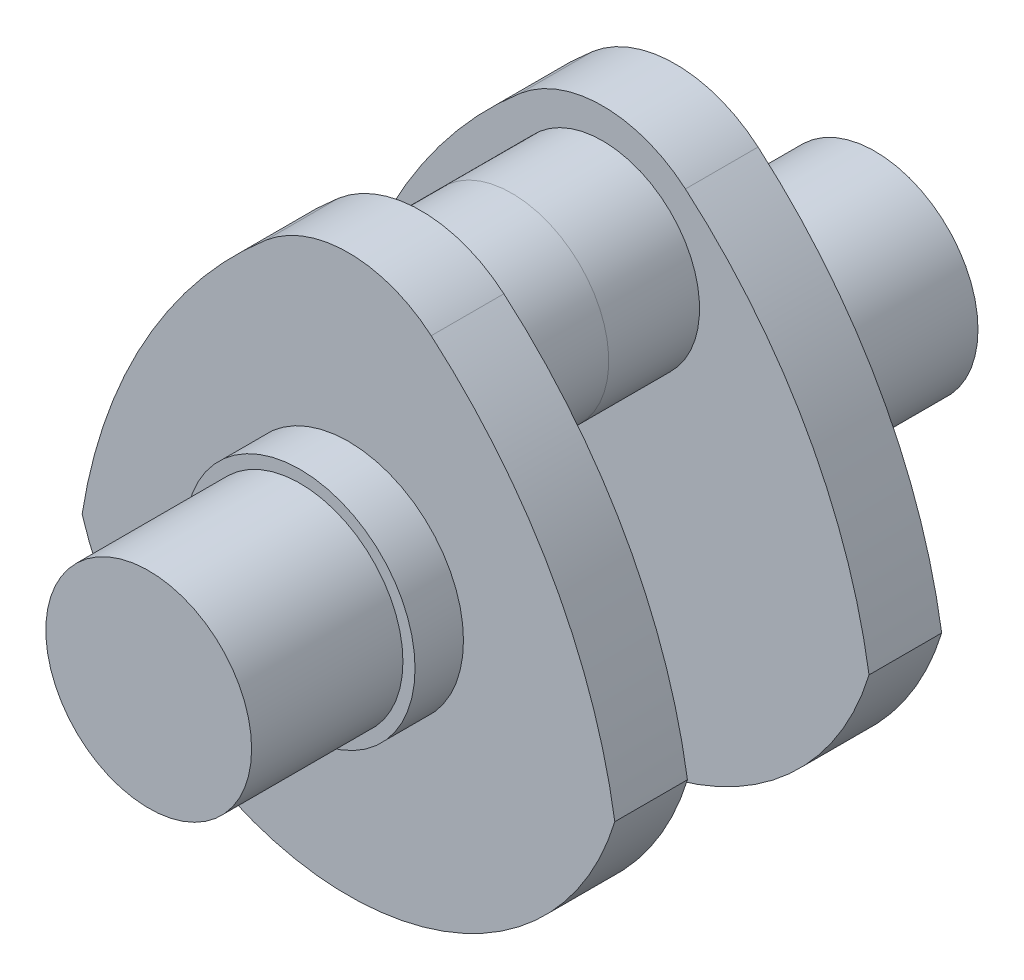
ISO-10303-21;
HEADER;
FILE_DESCRIPTION(('STEP AP214'),'2;1');
FILE_NAME('part.step','',(''),(''),'','','');
FILE_SCHEMA(('AUTOMOTIVE_DESIGN { 1 0 10303 214 1 1 1 1 }'));
ENDSEC;
DATA;
#1=APPLICATION_CONTEXT('core data for automotive mechanical design processes');
#2=APPLICATION_PROTOCOL_DEFINITION('international standard','automotive_design',2000,#1);
#3=PRODUCT_CONTEXT('',#1,'mechanical');
#4=PRODUCT('Part','Part','',(#3));
#5=PRODUCT_RELATED_PRODUCT_CATEGORY('part','',(#4));
#6=PRODUCT_DEFINITION_FORMATION('','',#4);
#7=PRODUCT_DEFINITION_CONTEXT('part definition',#1,'design');
#8=PRODUCT_DEFINITION('design','',#6,#7);
#9=PRODUCT_DEFINITION_SHAPE('','',#8);
#10=(LENGTH_UNIT() NAMED_UNIT(*) SI_UNIT(.MILLI.,.METRE.));
#11=(NAMED_UNIT(*) PLANE_ANGLE_UNIT() SI_UNIT($,.RADIAN.));
#12=(NAMED_UNIT(*) SI_UNIT($,.STERADIAN.) SOLID_ANGLE_UNIT());
#13=UNCERTAINTY_MEASURE_WITH_UNIT(LENGTH_MEASURE(1.E-05),#10,'distance_accuracy_value','');
#14=(GEOMETRIC_REPRESENTATION_CONTEXT(3) GLOBAL_UNCERTAINTY_ASSIGNED_CONTEXT((#13)) GLOBAL_UNIT_ASSIGNED_CONTEXT((#10,
#11,#12)) REPRESENTATION_CONTEXT('',''));
#15=CARTESIAN_POINT('',(0.,0.,0.));
#16=DIRECTION('',(0.,0.,1.));
#17=DIRECTION('',(1.,0.,0.));
#18=AXIS2_PLACEMENT_3D('',#15,#16,#17);
#19=CARTESIAN_POINT('',(0.,0.,-95.));
#20=DIRECTION('',(0.,0.,1.));
#21=DIRECTION('',(-1.,0.,0.));
#22=AXIS2_PLACEMENT_3D('',#19,#20,#21);
#23=CYLINDRICAL_SURFACE('',#22,17.);
#24=CARTESIAN_POINT('',(0.,0.,-95.));
#25=DIRECTION('',(0.,0.,1.));
#26=DIRECTION('',(1.,0.,0.));
#27=AXIS2_PLACEMENT_3D('',#24,#25,#26);
#28=CIRCLE('',#27,17.);
#29=CARTESIAN_POINT('',(17.,0.,-95.));
#30=VERTEX_POINT('',#29);
#31=EDGE_CURVE('E12',#30,#30,#28,.T.);
#32=ORIENTED_EDGE('',*,*,#31,.T.);
#33=EDGE_LOOP('',(#32));
#34=FACE_BOUND('',#33,.T.);
#35=CARTESIAN_POINT('',(0.,0.,-70.));
#36=DIRECTION('',(0.,0.,1.));
#37=DIRECTION('',(1.,0.,0.));
#38=AXIS2_PLACEMENT_3D('',#35,#36,#37);
#39=CIRCLE('',#38,17.);
#40=CARTESIAN_POINT('',(17.,0.,-70.));
#41=VERTEX_POINT('',#40);
#42=EDGE_CURVE('E56',#41,#41,#39,.T.);
#43=ORIENTED_EDGE('',*,*,#42,.F.);
#44=EDGE_LOOP('',(#43));
#45=FACE_BOUND('',#44,.T.);
#46=ADVANCED_FACE('F53',(#34,#45),#23,.T.);
#47=CARTESIAN_POINT('',(0.,0.,-95.));
#48=DIRECTION('',(0.,0.,-1.));
#49=DIRECTION('',(1.,0.,0.));
#50=AXIS2_PLACEMENT_3D('',#47,#48,#49);
#51=PLANE('',#50);
#52=ORIENTED_EDGE('',*,*,#31,.F.);
#53=EDGE_LOOP('',(#52));
#54=FACE_BOUND('',#53,.T.);
#55=ADVANCED_FACE('F161',(#54),#51,.T.);
#56=CARTESIAN_POINT('',(0.,0.,-62.));
#57=DIRECTION('',(0.,0.,-1.));
#58=DIRECTION('',(1.,0.,0.));
#59=AXIS2_PLACEMENT_3D('',#56,#57,#58);
#60=CYLINDRICAL_SURFACE('',#59,19.);
#61=CARTESIAN_POINT('',(0.,0.,-62.));
#62=DIRECTION('',(0.,0.,1.));
#63=DIRECTION('',(1.,0.,0.));
#64=AXIS2_PLACEMENT_3D('',#61,#62,#63);
#65=CIRCLE('',#64,19.);
#66=CARTESIAN_POINT('',(19.,0.,-62.));
#67=VERTEX_POINT('',#66);
#68=EDGE_CURVE('E144',#67,#67,#65,.T.);
#69=ORIENTED_EDGE('',*,*,#68,.F.);
#70=EDGE_LOOP('',(#69));
#71=FACE_BOUND('',#70,.T.);
#72=CARTESIAN_POINT('',(0.,0.,-70.));
#73=DIRECTION('',(0.,0.,1.));
#74=DIRECTION('',(1.,0.,0.));
#75=AXIS2_PLACEMENT_3D('',#72,#73,#74);
#76=CIRCLE('',#75,19.);
#77=CARTESIAN_POINT('',(19.,0.,-70.));
#78=VERTEX_POINT('',#77);
#79=EDGE_CURVE('E148',#78,#78,#76,.T.);
#80=ORIENTED_EDGE('',*,*,#79,.T.);
#81=EDGE_LOOP('',(#80));
#82=FACE_BOUND('',#81,.T.);
#83=ADVANCED_FACE('F166',(#71,#82),#60,.T.);
#84=CARTESIAN_POINT('',(0.,0.,-70.));
#85=DIRECTION('',(0.,0.,-1.));
#86=DIRECTION('',(1.,0.,0.));
#87=AXIS2_PLACEMENT_3D('',#84,#85,#86);
#88=PLANE('',#87);
#89=ORIENTED_EDGE('',*,*,#42,.T.);
#90=EDGE_LOOP('',(#89));
#91=FACE_BOUND('',#90,.T.);
#92=ORIENTED_EDGE('',*,*,#79,.F.);
#93=EDGE_LOOP('',(#92));
#94=FACE_BOUND('',#93,.T.);
#95=ADVANCED_FACE('F157',(#91,#94),#88,.T.);
#96=CARTESIAN_POINT('',(-44.9094542035734,-27.3845485151599,-50.));
#97=DIRECTION('',(0.,0.,-1.));
#98=DIRECTION('',(1.,0.,0.));
#99=AXIS2_PLACEMENT_3D('',#96,#97,#98);
#100=CYLINDRICAL_SURFACE('',#99,90.);
#101=CARTESIAN_POINT('',(-44.9094542035734,-27.3845485151599,-62.));
#102=DIRECTION('',(0.,0.,-1.));
#103=DIRECTION('',(-1.,0.,0.));
#104=AXIS2_PLACEMENT_3D('',#101,#102,#103);
#105=CIRCLE('',#104,90.);
#106=CARTESIAN_POINT('',(13.6680947576093,40.9431234611356,-62.));
#107=VERTEX_POINT('',#106);
#108=CARTESIAN_POINT('',(44.,-13.4164078649987,-62.));
#109=VERTEX_POINT('',#108);
#110=EDGE_CURVE('E127',#107,#109,#105,.T.);
#111=ORIENTED_EDGE('',*,*,#110,.F.);
#112=DIRECTION('',(0.,0.,-1.));
#113=VECTOR('',#112,1.);
#114=CARTESIAN_POINT('',(13.6680947576093,40.9431234611356,-50.));
#115=LINE('',#114,#113);
#116=CARTESIAN_POINT('',(13.6680947576093,40.9431234611356,-50.));
#117=VERTEX_POINT('',#116);
#118=EDGE_CURVE('E126',#117,#107,#115,.T.);
#119=ORIENTED_EDGE('',*,*,#118,.F.);
#120=CARTESIAN_POINT('',(-44.9094542035734,-27.3845485151599,-50.));
#121=DIRECTION('',(0.,0.,-1.));
#122=DIRECTION('',(-1.,0.,0.));
#123=AXIS2_PLACEMENT_3D('',#120,#121,#122);
#124=CIRCLE('',#123,90.);
#125=CARTESIAN_POINT('',(44.,-13.4164078649987,-50.));
#126=VERTEX_POINT('',#125);
#127=EDGE_CURVE('E118',#117,#126,#124,.T.);
#128=ORIENTED_EDGE('',*,*,#127,.T.);
#129=DIRECTION('',(0.,0.,-1.));
#130=VECTOR('',#129,1.);
#131=CARTESIAN_POINT('',(44.,-13.4164078649987,-50.));
#132=LINE('',#131,#130);
#133=EDGE_CURVE('E111',#126,#109,#132,.T.);
#134=ORIENTED_EDGE('',*,*,#133,.T.);
#135=EDGE_LOOP('',(#111,#119,#128,#134));
#136=FACE_BOUND('',#135,.T.);
#137=ADVANCED_FACE('F177',(#136),#100,.T.);
#138=CARTESIAN_POINT('',(0.,0.,-50.));
#139=DIRECTION('',(0.,0.,-1.));
#140=DIRECTION('',(1.,0.,0.));
#141=AXIS2_PLACEMENT_3D('',#138,#139,#140);
#142=CYLINDRICAL_SURFACE('',#141,46.);
#143=CARTESIAN_POINT('',(0.,0.,-62.));
#144=DIRECTION('',(0.,0.,-1.));
#145=DIRECTION('',(-1.,0.,0.));
#146=AXIS2_PLACEMENT_3D('',#143,#144,#145);
#147=CIRCLE('',#146,46.);
#148=CARTESIAN_POINT('',(-44.,-13.4164078649987,-62.));
#149=VERTEX_POINT('',#148);
#150=EDGE_CURVE('E130',#109,#149,#147,.T.);
#151=ORIENTED_EDGE('',*,*,#150,.F.);
#152=ORIENTED_EDGE('',*,*,#133,.F.);
#153=CARTESIAN_POINT('',(0.,0.,-50.));
#154=DIRECTION('',(0.,0.,-1.));
#155=DIRECTION('',(-1.,0.,0.));
#156=AXIS2_PLACEMENT_3D('',#153,#154,#155);
#157=CIRCLE('',#156,46.);
#158=CARTESIAN_POINT('',(-44.,-13.4164078649987,-50.));
#159=VERTEX_POINT('',#158);
#160=EDGE_CURVE('E95',#126,#159,#157,.T.);
#161=ORIENTED_EDGE('',*,*,#160,.T.);
#162=DIRECTION('',(0.,0.,-1.));
#163=VECTOR('',#162,1.);
#164=CARTESIAN_POINT('',(-44.,-13.4164078649987,-50.));
#165=LINE('',#164,#163);
#166=EDGE_CURVE('E105',#159,#149,#165,.T.);
#167=ORIENTED_EDGE('',*,*,#166,.T.);
#168=EDGE_LOOP('',(#151,#152,#161,#167));
#169=FACE_BOUND('',#168,.T.);
#170=ADVANCED_FACE('F114',(#169),#142,.T.);
#171=CARTESIAN_POINT('',(44.9094542035734,-27.3845485151599,-50.));
#172=DIRECTION('',(0.,0.,-1.));
#173=DIRECTION('',(1.,0.,0.));
#174=AXIS2_PLACEMENT_3D('',#171,#172,#173);
#175=CYLINDRICAL_SURFACE('',#174,90.);
#176=CARTESIAN_POINT('',(44.9094542035734,-27.3845485151599,-62.));
#177=DIRECTION('',(0.,0.,-1.));
#178=DIRECTION('',(1.,0.,0.));
#179=AXIS2_PLACEMENT_3D('',#176,#177,#178);
#180=CIRCLE('',#179,90.);
#181=CARTESIAN_POINT('',(-13.6680947576093,40.9431234611356,-62.));
#182=VERTEX_POINT('',#181);
#183=EDGE_CURVE('E107',#149,#182,#180,.T.);
#184=ORIENTED_EDGE('',*,*,#183,.F.);
#185=ORIENTED_EDGE('',*,*,#166,.F.);
#186=CARTESIAN_POINT('',(44.9094542035734,-27.3845485151599,-50.));
#187=DIRECTION('',(0.,0.,-1.));
#188=DIRECTION('',(1.,0.,0.));
#189=AXIS2_PLACEMENT_3D('',#186,#187,#188);
#190=CIRCLE('',#189,90.);
#191=CARTESIAN_POINT('',(-13.6680947576093,40.9431234611356,-50.));
#192=VERTEX_POINT('',#191);
#193=EDGE_CURVE('E98',#159,#192,#190,.T.);
#194=ORIENTED_EDGE('',*,*,#193,.T.);
#195=DIRECTION('',(0.,0.,-1.));
#196=VECTOR('',#195,1.);
#197=CARTESIAN_POINT('',(-13.6680947576093,40.9431234611356,-50.));
#198=LINE('',#197,#196);
#199=EDGE_CURVE('E112',#192,#182,#198,.T.);
#200=ORIENTED_EDGE('',*,*,#199,.T.);
#201=EDGE_LOOP('',(#184,#185,#194,#200));
#202=FACE_BOUND('',#201,.T.);
#203=ADVANCED_FACE('F106',(#202),#175,.T.);
#204=CARTESIAN_POINT('',(0.,25.,-50.));
#205=DIRECTION('',(0.,0.,-1.));
#206=DIRECTION('',(1.,0.,0.));
#207=AXIS2_PLACEMENT_3D('',#204,#205,#206);
#208=CYLINDRICAL_SURFACE('',#207,21.);
#209=CARTESIAN_POINT('',(0.,25.,-62.));
#210=DIRECTION('',(0.,0.,-1.));
#211=DIRECTION('',(-1.,0.,0.));
#212=AXIS2_PLACEMENT_3D('',#209,#210,#211);
#213=CIRCLE('',#212,21.);
#214=EDGE_CURVE('E84',#182,#107,#213,.T.);
#215=ORIENTED_EDGE('',*,*,#214,.F.);
#216=ORIENTED_EDGE('',*,*,#199,.F.);
#217=CARTESIAN_POINT('',(0.,25.,-50.));
#218=DIRECTION('',(0.,0.,-1.));
#219=DIRECTION('',(-1.,0.,0.));
#220=AXIS2_PLACEMENT_3D('',#217,#218,#219);
#221=CIRCLE('',#220,21.);
#222=EDGE_CURVE('E70',#192,#117,#221,.T.);
#223=ORIENTED_EDGE('',*,*,#222,.T.);
#224=ORIENTED_EDGE('',*,*,#118,.T.);
#225=EDGE_LOOP('',(#215,#216,#223,#224));
#226=FACE_BOUND('',#225,.T.);
#227=ADVANCED_FACE('F185',(#226),#208,.T.);
#228=CARTESIAN_POINT('',(-22.4547271017867,-13.69227425758,-50.));
#229=DIRECTION('',(0.,0.,1.));
#230=DIRECTION('',(-1.,0.,0.));
#231=AXIS2_PLACEMENT_3D('',#228,#229,#230);
#232=PLANE('',#231);
#233=CARTESIAN_POINT('',(0.,25.,-50.));
#234=DIRECTION('',(0.,0.,-1.));
#235=DIRECTION('',(-1.,0.,0.));
#236=AXIS2_PLACEMENT_3D('',#233,#234,#235);
#237=CIRCLE('',#236,16.);
#238=CARTESIAN_POINT('',(-16.,25.,-50.));
#239=VERTEX_POINT('',#238);
#240=EDGE_CURVE('E207',#239,#239,#237,.T.);
#241=ORIENTED_EDGE('',*,*,#240,.T.);
#242=EDGE_LOOP('',(#241));
#243=FACE_BOUND('',#242,.T.);
#244=ORIENTED_EDGE('',*,*,#127,.F.);
#245=ORIENTED_EDGE('',*,*,#222,.F.);
#246=ORIENTED_EDGE('',*,*,#193,.F.);
#247=ORIENTED_EDGE('',*,*,#160,.F.);
#248=EDGE_LOOP('',(#244,#245,#246,#247));
#249=FACE_BOUND('',#248,.T.);
#250=ADVANCED_FACE('F100',(#243,#249),#232,.T.);
#251=CARTESIAN_POINT('',(-22.4547271017867,-13.69227425758,-62.));
#252=DIRECTION('',(0.,0.,1.));
#253=DIRECTION('',(-1.,0.,0.));
#254=AXIS2_PLACEMENT_3D('',#251,#252,#253);
#255=PLANE('',#254);
#256=ORIENTED_EDGE('',*,*,#68,.T.);
#257=EDGE_LOOP('',(#256));
#258=FACE_BOUND('',#257,.T.);
#259=ORIENTED_EDGE('',*,*,#110,.T.);
#260=ORIENTED_EDGE('',*,*,#150,.T.);
#261=ORIENTED_EDGE('',*,*,#183,.T.);
#262=ORIENTED_EDGE('',*,*,#214,.T.);
#263=EDGE_LOOP('',(#259,#260,#261,#262));
#264=FACE_BOUND('',#263,.T.);
#265=ADVANCED_FACE('F188',(#258,#264),#255,.F.);
#266=CARTESIAN_POINT('',(0.,25.,-35.));
#267=DIRECTION('',(0.,0.,-1.));
#268=DIRECTION('',(1.,0.,0.));
#269=AXIS2_PLACEMENT_3D('',#266,#267,#268);
#270=CYLINDRICAL_SURFACE('',#269,16.);
#271=CARTESIAN_POINT('',(0.,25.,-35.));
#272=DIRECTION('',(0.,0.,-1.));
#273=DIRECTION('',(-1.,0.,0.));
#274=AXIS2_PLACEMENT_3D('',#271,#272,#273);
#275=CIRCLE('',#274,16.);
#276=CARTESIAN_POINT('',(-16.,25.,-35.));
#277=VERTEX_POINT('',#276);
#278=EDGE_CURVE('E131',#277,#277,#275,.T.);
#279=ORIENTED_EDGE('',*,*,#278,.T.);
#280=EDGE_LOOP('',(#279));
#281=FACE_BOUND('',#280,.T.);
#282=ORIENTED_EDGE('',*,*,#240,.F.);
#283=EDGE_LOOP('',(#282));
#284=FACE_BOUND('',#283,.T.);
#285=ADVANCED_FACE('F191',(#281,#284),#270,.T.);
#286=CARTESIAN_POINT('',(0.,25.,-35.));
#287=DIRECTION('',(0.,0.,1.));
#288=DIRECTION('',(-1.,0.,0.));
#289=AXIS2_PLACEMENT_3D('',#286,#287,#288);
#290=PLANE('',#289);
#291=ORIENTED_EDGE('',*,*,#278,.F.);
#292=EDGE_LOOP('',(#291));
#293=FACE_BOUND('',#292,.T.);
#294=ADVANCED_FACE('F198',(#293),#290,.T.);
#295=CLOSED_SHELL('',(#46,#55,#83,#95,#137,#170,#203,#227,#250,#265,#285,#294));
#296=MANIFOLD_SOLID_BREP('B2',#295);
#297=CARTESIAN_POINT('',(0.,0.,25.));
#298=DIRECTION('',(0.,0.,-1.));
#299=DIRECTION('',(-1.,0.,0.));
#300=AXIS2_PLACEMENT_3D('',#297,#298,#299);
#301=CYLINDRICAL_SURFACE('',#300,17.);
#302=CARTESIAN_POINT('',(0.,0.,25.));
#303=DIRECTION('',(0.,0.,1.));
#304=DIRECTION('',(1.,0.,0.));
#305=AXIS2_PLACEMENT_3D('',#302,#303,#304);
#306=CIRCLE('',#305,17.);
#307=CARTESIAN_POINT('',(17.,0.,25.));
#308=VERTEX_POINT('',#307);
#309=EDGE_CURVE('E51',#308,#308,#306,.T.);
#310=ORIENTED_EDGE('',*,*,#309,.F.);
#311=EDGE_LOOP('',(#310));
#312=FACE_BOUND('',#311,.T.);
#313=CARTESIAN_POINT('',(0.,0.,0.));
#314=DIRECTION('',(0.,0.,1.));
#315=DIRECTION('',(1.,0.,0.));
#316=AXIS2_PLACEMENT_3D('',#313,#314,#315);
#317=CIRCLE('',#316,17.);
#318=CARTESIAN_POINT('',(17.,0.,0.));
#319=VERTEX_POINT('',#318);
#320=EDGE_CURVE('E312',#319,#319,#317,.T.);
#321=ORIENTED_EDGE('',*,*,#320,.T.);
#322=EDGE_LOOP('',(#321));
#323=FACE_BOUND('',#322,.T.);
#324=ADVANCED_FACE('F309',(#312,#323),#301,.T.);
#325=CARTESIAN_POINT('',(0.,0.,25.));
#326=DIRECTION('',(0.,0.,1.));
#327=DIRECTION('',(1.,0.,0.));
#328=AXIS2_PLACEMENT_3D('',#325,#326,#327);
#329=PLANE('',#328);
#330=ORIENTED_EDGE('',*,*,#309,.T.);
#331=EDGE_LOOP('',(#330));
#332=FACE_BOUND('',#331,.T.);
#333=ADVANCED_FACE('F408',(#332),#329,.T.);
#334=CARTESIAN_POINT('',(0.,0.,-8.));
#335=DIRECTION('',(0.,0.,1.));
#336=DIRECTION('',(1.,0.,0.));
#337=AXIS2_PLACEMENT_3D('',#334,#335,#336);
#338=CYLINDRICAL_SURFACE('',#337,19.);
#339=CARTESIAN_POINT('',(0.,0.,-8.));
#340=DIRECTION('',(0.,0.,1.));
#341=DIRECTION('',(1.,0.,0.));
#342=AXIS2_PLACEMENT_3D('',#339,#340,#341);
#343=CIRCLE('',#342,19.);
#344=CARTESIAN_POINT('',(19.,0.,-8.));
#345=VERTEX_POINT('',#344);
#346=EDGE_CURVE('E386',#345,#345,#343,.T.);
#347=ORIENTED_EDGE('',*,*,#346,.T.);
#348=EDGE_LOOP('',(#347));
#349=FACE_BOUND('',#348,.T.);
#350=CARTESIAN_POINT('',(0.,0.,0.));
#351=DIRECTION('',(0.,0.,1.));
#352=DIRECTION('',(1.,0.,0.));
#353=AXIS2_PLACEMENT_3D('',#350,#351,#352);
#354=CIRCLE('',#353,19.);
#355=CARTESIAN_POINT('',(19.,0.,0.));
#356=VERTEX_POINT('',#355);
#357=EDGE_CURVE('E389',#356,#356,#354,.T.);
#358=ORIENTED_EDGE('',*,*,#357,.F.);
#359=EDGE_LOOP('',(#358));
#360=FACE_BOUND('',#359,.T.);
#361=ADVANCED_FACE('F400',(#349,#360),#338,.T.);
#362=CARTESIAN_POINT('',(0.,0.,0.));
#363=DIRECTION('',(0.,0.,1.));
#364=DIRECTION('',(1.,0.,0.));
#365=AXIS2_PLACEMENT_3D('',#362,#363,#364);
#366=PLANE('',#365);
#367=ORIENTED_EDGE('',*,*,#320,.F.);
#368=EDGE_LOOP('',(#367));
#369=FACE_BOUND('',#368,.T.);
#370=ORIENTED_EDGE('',*,*,#357,.T.);
#371=EDGE_LOOP('',(#370));
#372=FACE_BOUND('',#371,.T.);
#373=ADVANCED_FACE('F397',(#369,#372),#366,.T.);
#374=CARTESIAN_POINT('',(-44.9094542035734,-27.3845485151599,-20.));
#375=DIRECTION('',(0.,0.,1.));
#376=DIRECTION('',(1.,0.,0.));
#377=AXIS2_PLACEMENT_3D('',#374,#375,#376);
#378=CYLINDRICAL_SURFACE('',#377,90.);
#379=CARTESIAN_POINT('',(-44.9094542035734,-27.3845485151599,-8.));
#380=DIRECTION('',(0.,0.,-1.));
#381=DIRECTION('',(-1.,0.,0.));
#382=AXIS2_PLACEMENT_3D('',#379,#380,#381);
#383=CIRCLE('',#382,90.);
#384=CARTESIAN_POINT('',(13.6680947576093,40.9431234611356,-8.));
#385=VERTEX_POINT('',#384);
#386=CARTESIAN_POINT('',(44.,-13.4164078649987,-8.));
#387=VERTEX_POINT('',#386);
#388=EDGE_CURVE('E376',#385,#387,#383,.T.);
#389=ORIENTED_EDGE('',*,*,#388,.T.);
#390=DIRECTION('',(0.,0.,1.));
#391=VECTOR('',#390,1.);
#392=CARTESIAN_POINT('',(44.,-13.4164078649987,-20.));
#393=LINE('',#392,#391);
#394=CARTESIAN_POINT('',(44.,-13.4164078649987,-20.));
#395=VERTEX_POINT('',#394);
#396=EDGE_CURVE('E367',#395,#387,#393,.T.);
#397=ORIENTED_EDGE('',*,*,#396,.F.);
#398=CARTESIAN_POINT('',(-44.9094542035734,-27.3845485151599,-20.));
#399=DIRECTION('',(0.,0.,-1.));
#400=DIRECTION('',(-1.,0.,0.));
#401=AXIS2_PLACEMENT_3D('',#398,#399,#400);
#402=CIRCLE('',#401,90.);
#403=CARTESIAN_POINT('',(13.6680947576093,40.9431234611356,-20.));
#404=VERTEX_POINT('',#403);
#405=EDGE_CURVE('E361',#404,#395,#402,.T.);
#406=ORIENTED_EDGE('',*,*,#405,.F.);
#407=DIRECTION('',(0.,0.,1.));
#408=VECTOR('',#407,1.);
#409=CARTESIAN_POINT('',(13.6680947576093,40.9431234611356,-20.));
#410=LINE('',#409,#408);
#411=EDGE_CURVE('E372',#404,#385,#410,.T.);
#412=ORIENTED_EDGE('',*,*,#411,.T.);
#413=EDGE_LOOP('',(#389,#397,#406,#412));
#414=FACE_BOUND('',#413,.T.);
#415=ADVANCED_FACE('F399',(#414),#378,.T.);
#416=CARTESIAN_POINT('',(0.,0.,-20.));
#417=DIRECTION('',(0.,0.,1.));
#418=DIRECTION('',(1.,0.,0.));
#419=AXIS2_PLACEMENT_3D('',#416,#417,#418);
#420=CYLINDRICAL_SURFACE('',#419,46.);
#421=CARTESIAN_POINT('',(0.,0.,-8.));
#422=DIRECTION('',(0.,0.,-1.));
#423=DIRECTION('',(-1.,0.,0.));
#424=AXIS2_PLACEMENT_3D('',#421,#422,#423);
#425=CIRCLE('',#424,46.);
#426=CARTESIAN_POINT('',(-44.,-13.4164078649987,-8.));
#427=VERTEX_POINT('',#426);
#428=EDGE_CURVE('E366',#387,#427,#425,.T.);
#429=ORIENTED_EDGE('',*,*,#428,.T.);
#430=DIRECTION('',(0.,0.,1.));
#431=VECTOR('',#430,1.);
#432=CARTESIAN_POINT('',(-44.,-13.4164078649987,-20.));
#433=LINE('',#432,#431);
#434=CARTESIAN_POINT('',(-44.,-13.4164078649987,-20.));
#435=VERTEX_POINT('',#434);
#436=EDGE_CURVE('E364',#435,#427,#433,.T.);
#437=ORIENTED_EDGE('',*,*,#436,.F.);
#438=CARTESIAN_POINT('',(0.,0.,-20.));
#439=DIRECTION('',(0.,0.,-1.));
#440=DIRECTION('',(-1.,0.,0.));
#441=AXIS2_PLACEMENT_3D('',#438,#439,#440);
#442=CIRCLE('',#441,46.);
#443=EDGE_CURVE('E356',#395,#435,#442,.T.);
#444=ORIENTED_EDGE('',*,*,#443,.F.);
#445=ORIENTED_EDGE('',*,*,#396,.T.);
#446=EDGE_LOOP('',(#429,#437,#444,#445));
#447=FACE_BOUND('',#446,.T.);
#448=ADVANCED_FACE('F365',(#447),#420,.T.);
#449=CARTESIAN_POINT('',(44.9094542035734,-27.3845485151599,-20.));
#450=DIRECTION('',(0.,0.,1.));
#451=DIRECTION('',(1.,0.,0.));
#452=AXIS2_PLACEMENT_3D('',#449,#450,#451);
#453=CYLINDRICAL_SURFACE('',#452,90.);
#454=CARTESIAN_POINT('',(44.9094542035734,-27.3845485151599,-8.));
#455=DIRECTION('',(0.,0.,-1.));
#456=DIRECTION('',(1.,0.,0.));
#457=AXIS2_PLACEMENT_3D('',#454,#455,#456);
#458=CIRCLE('',#457,90.);
#459=CARTESIAN_POINT('',(-13.6680947576093,40.9431234611356,-8.));
#460=VERTEX_POINT('',#459);
#461=EDGE_CURVE('E342',#427,#460,#458,.T.);
#462=ORIENTED_EDGE('',*,*,#461,.T.);
#463=DIRECTION('',(0.,0.,1.));
#464=VECTOR('',#463,1.);
#465=CARTESIAN_POINT('',(-13.6680947576093,40.9431234611356,-20.));
#466=LINE('',#465,#464);
#467=CARTESIAN_POINT('',(-13.6680947576093,40.9431234611356,-20.));
#468=VERTEX_POINT('',#467);
#469=EDGE_CURVE('E368',#468,#460,#466,.T.);
#470=ORIENTED_EDGE('',*,*,#469,.F.);
#471=CARTESIAN_POINT('',(44.9094542035734,-27.3845485151599,-20.));
#472=DIRECTION('',(0.,0.,-1.));
#473=DIRECTION('',(1.,0.,0.));
#474=AXIS2_PLACEMENT_3D('',#471,#472,#473);
#475=CIRCLE('',#474,90.);
#476=EDGE_CURVE('E359',#435,#468,#475,.T.);
#477=ORIENTED_EDGE('',*,*,#476,.F.);
#478=ORIENTED_EDGE('',*,*,#436,.T.);
#479=EDGE_LOOP('',(#462,#470,#477,#478));
#480=FACE_BOUND('',#479,.T.);
#481=ADVANCED_FACE('F370',(#480),#453,.T.);
#482=CARTESIAN_POINT('',(0.,25.,-20.));
#483=DIRECTION('',(0.,0.,1.));
#484=DIRECTION('',(1.,0.,0.));
#485=AXIS2_PLACEMENT_3D('',#482,#483,#484);
#486=CYLINDRICAL_SURFACE('',#485,21.);
#487=CARTESIAN_POINT('',(0.,25.,-8.));
#488=DIRECTION('',(0.,0.,-1.));
#489=DIRECTION('',(-1.,0.,0.));
#490=AXIS2_PLACEMENT_3D('',#487,#488,#489);
#491=CIRCLE('',#490,21.);
#492=EDGE_CURVE('E348',#460,#385,#491,.T.);
#493=ORIENTED_EDGE('',*,*,#492,.T.);
#494=ORIENTED_EDGE('',*,*,#411,.F.);
#495=CARTESIAN_POINT('',(0.,25.,-20.));
#496=DIRECTION('',(0.,0.,-1.));
#497=DIRECTION('',(-1.,0.,0.));
#498=AXIS2_PLACEMENT_3D('',#495,#496,#497);
#499=CIRCLE('',#498,21.);
#500=EDGE_CURVE('E325',#468,#404,#499,.T.);
#501=ORIENTED_EDGE('',*,*,#500,.F.);
#502=ORIENTED_EDGE('',*,*,#469,.T.);
#503=EDGE_LOOP('',(#493,#494,#501,#502));
#504=FACE_BOUND('',#503,.T.);
#505=ADVANCED_FACE('F455',(#504),#486,.T.);
#506=CARTESIAN_POINT('',(-22.4547271017867,-13.69227425758,-20.));
#507=DIRECTION('',(0.,0.,-1.));
#508=DIRECTION('',(-1.,0.,0.));
#509=AXIS2_PLACEMENT_3D('',#506,#507,#508);
#510=PLANE('',#509);
#511=CARTESIAN_POINT('',(0.,25.,-20.));
#512=DIRECTION('',(0.,0.,-1.));
#513=DIRECTION('',(-1.,0.,0.));
#514=AXIS2_PLACEMENT_3D('',#511,#512,#513);
#515=CIRCLE('',#514,16.);
#516=CARTESIAN_POINT('',(-16.,25.,-20.));
#517=VERTEX_POINT('',#516);
#518=EDGE_CURVE('E534',#517,#517,#515,.T.);
#519=ORIENTED_EDGE('',*,*,#518,.F.);
#520=EDGE_LOOP('',(#519));
#521=FACE_BOUND('',#520,.T.);
#522=ORIENTED_EDGE('',*,*,#405,.T.);
#523=ORIENTED_EDGE('',*,*,#443,.T.);
#524=ORIENTED_EDGE('',*,*,#476,.T.);
#525=ORIENTED_EDGE('',*,*,#500,.T.);
#526=EDGE_LOOP('',(#522,#523,#524,#525));
#527=FACE_BOUND('',#526,.T.);
#528=ADVANCED_FACE('F357',(#521,#527),#510,.T.);
#529=CARTESIAN_POINT('',(-22.4547271017867,-13.69227425758,-8.));
#530=DIRECTION('',(0.,0.,-1.));
#531=DIRECTION('',(-1.,0.,0.));
#532=AXIS2_PLACEMENT_3D('',#529,#530,#531);
#533=PLANE('',#532);
#534=ORIENTED_EDGE('',*,*,#346,.F.);
#535=EDGE_LOOP('',(#534));
#536=FACE_BOUND('',#535,.T.);
#537=ORIENTED_EDGE('',*,*,#388,.F.);
#538=ORIENTED_EDGE('',*,*,#492,.F.);
#539=ORIENTED_EDGE('',*,*,#461,.F.);
#540=ORIENTED_EDGE('',*,*,#428,.F.);
#541=EDGE_LOOP('',(#537,#538,#539,#540));
#542=FACE_BOUND('',#541,.T.);
#543=ADVANCED_FACE('F472',(#536,#542),#533,.F.);
#544=CARTESIAN_POINT('',(0.,25.,-35.));
#545=DIRECTION('',(0.,0.,1.));
#546=DIRECTION('',(1.,0.,0.));
#547=AXIS2_PLACEMENT_3D('',#544,#545,#546);
#548=CYLINDRICAL_SURFACE('',#547,16.);
#549=CARTESIAN_POINT('',(0.,25.,-35.));
#550=DIRECTION('',(0.,0.,-1.));
#551=DIRECTION('',(-1.,0.,0.));
#552=AXIS2_PLACEMENT_3D('',#549,#550,#551);
#553=CIRCLE('',#552,16.);
#554=CARTESIAN_POINT('',(-16.,25.,-35.));
#555=VERTEX_POINT('',#554);
#556=EDGE_CURVE('E379',#555,#555,#553,.T.);
#557=ORIENTED_EDGE('',*,*,#556,.F.);
#558=EDGE_LOOP('',(#557));
#559=FACE_BOUND('',#558,.T.);
#560=ORIENTED_EDGE('',*,*,#518,.T.);
#561=EDGE_LOOP('',(#560));
#562=FACE_BOUND('',#561,.T.);
#563=ADVANCED_FACE('F477',(#559,#562),#548,.T.);
#564=CARTESIAN_POINT('',(0.,25.,-35.));
#565=DIRECTION('',(0.,0.,-1.));
#566=DIRECTION('',(-1.,0.,0.));
#567=AXIS2_PLACEMENT_3D('',#564,#565,#566);
#568=PLANE('',#567);
#569=ORIENTED_EDGE('',*,*,#556,.T.);
#570=EDGE_LOOP('',(#569));
#571=FACE_BOUND('',#570,.T.);
#572=ADVANCED_FACE('F496',(#571),#568,.T.);
#573=CLOSED_SHELL('',(#324,#333,#361,#373,#415,#448,#481,#505,#528,#543,#563,#572));
#574=MANIFOLD_SOLID_BREP('B6',#573);
#575=ADVANCED_BREP_SHAPE_REPRESENTATION('',(#18,#296,#574),#14);
#576=SHAPE_DEFINITION_REPRESENTATION(#9,#575);
ENDSEC;
END-ISO-10303-21;
